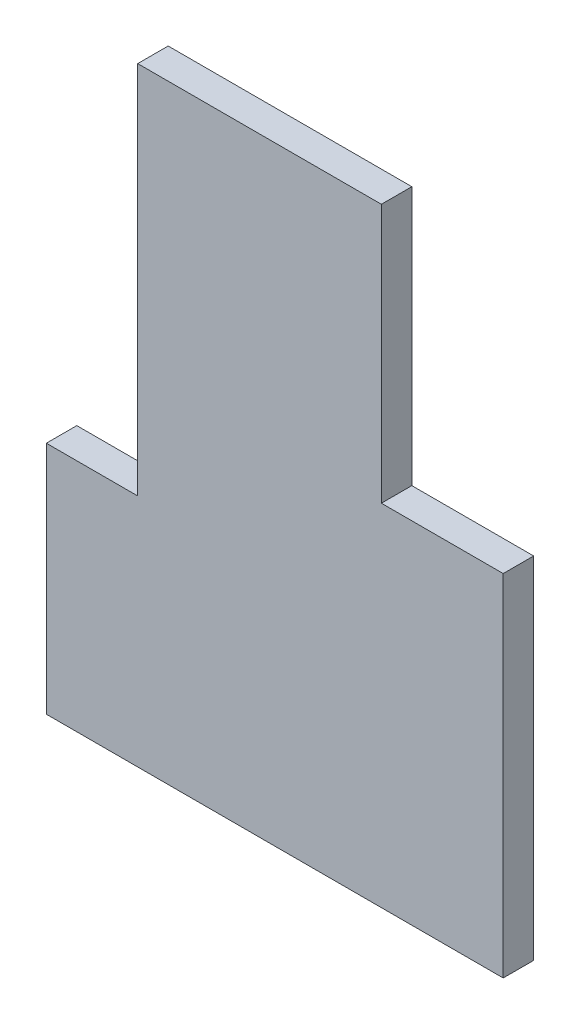
ISO-10303-21;
HEADER;
FILE_DESCRIPTION(('STEP AP214'),'2;1');
FILE_NAME('part.step','',(''),(''),'','','');
FILE_SCHEMA(('AUTOMOTIVE_DESIGN { 1 0 10303 214 1 1 1 1 }'));
ENDSEC;
DATA;
#1=APPLICATION_CONTEXT('core data for automotive mechanical design processes');
#2=APPLICATION_PROTOCOL_DEFINITION('international standard','automotive_design',2000,#1);
#3=PRODUCT_CONTEXT('',#1,'mechanical');
#4=PRODUCT('Part','Part','',(#3));
#5=PRODUCT_RELATED_PRODUCT_CATEGORY('part','',(#4));
#6=PRODUCT_DEFINITION_FORMATION('','',#4);
#7=PRODUCT_DEFINITION_CONTEXT('part definition',#1,'design');
#8=PRODUCT_DEFINITION('design','',#6,#7);
#9=PRODUCT_DEFINITION_SHAPE('','',#8);
#10=(LENGTH_UNIT() NAMED_UNIT(*) SI_UNIT(.MILLI.,.METRE.));
#11=(NAMED_UNIT(*) PLANE_ANGLE_UNIT() SI_UNIT($,.RADIAN.));
#12=(NAMED_UNIT(*) SI_UNIT($,.STERADIAN.) SOLID_ANGLE_UNIT());
#13=UNCERTAINTY_MEASURE_WITH_UNIT(LENGTH_MEASURE(1.E-05),#10,'distance_accuracy_value','');
#14=(GEOMETRIC_REPRESENTATION_CONTEXT(3) GLOBAL_UNCERTAINTY_ASSIGNED_CONTEXT((#13)) GLOBAL_UNIT_ASSIGNED_CONTEXT((#10,
#11,#12)) REPRESENTATION_CONTEXT('',''));
#15=CARTESIAN_POINT('',(0.,0.,0.));
#16=DIRECTION('',(0.,0.,1.));
#17=DIRECTION('',(1.,0.,0.));
#18=AXIS2_PLACEMENT_3D('',#15,#16,#17);
#19=CARTESIAN_POINT('',(-35.4556509146341,56.3295373294337,10.));
#20=DIRECTION('',(1.,0.,0.));
#21=DIRECTION('',(0.,0.,-1.));
#22=AXIS2_PLACEMENT_3D('',#19,#20,#21);
#23=PLANE('',#22);
#24=DIRECTION('',(0.,-1.,0.));
#25=VECTOR('',#24,1.);
#26=CARTESIAN_POINT('',(-35.4556509146341,56.3295373294337,0.));
#27=LINE('',#26,#25);
#28=CARTESIAN_POINT('',(-35.4556509146341,56.3295373294337,0.));
#29=VERTEX_POINT('',#28);
#30=CARTESIAN_POINT('',(-35.4556509146341,-20.7342987804878,0.));
#31=VERTEX_POINT('',#30);
#32=EDGE_CURVE('E129',#29,#31,#27,.T.);
#33=ORIENTED_EDGE('',*,*,#32,.T.);
#34=DIRECTION('',(0.,0.,-1.));
#35=VECTOR('',#34,1.);
#36=CARTESIAN_POINT('',(-35.4556509146341,-20.7342987804878,10.));
#37=LINE('',#36,#35);
#38=CARTESIAN_POINT('',(-35.4556509146341,-20.7342987804878,10.));
#39=VERTEX_POINT('',#38);
#40=EDGE_CURVE('E11',#39,#31,#37,.T.);
#41=ORIENTED_EDGE('',*,*,#40,.F.);
#42=DIRECTION('',(0.,-1.,0.));
#43=VECTOR('',#42,1.);
#44=CARTESIAN_POINT('',(-35.4556509146341,56.3295373294337,10.));
#45=LINE('',#44,#43);
#46=CARTESIAN_POINT('',(-35.4556509146341,56.3295373294337,10.));
#47=VERTEX_POINT('',#46);
#48=EDGE_CURVE('E143',#47,#39,#45,.T.);
#49=ORIENTED_EDGE('',*,*,#48,.F.);
#50=DIRECTION('',(0.,0.,-1.));
#51=VECTOR('',#50,1.);
#52=CARTESIAN_POINT('',(-35.4556509146341,56.3295373294337,10.));
#53=LINE('',#52,#51);
#54=EDGE_CURVE('E125',#47,#29,#53,.T.);
#55=ORIENTED_EDGE('',*,*,#54,.T.);
#56=EDGE_LOOP('',(#33,#41,#49,#55));
#57=FACE_BOUND('',#56,.T.);
#58=ADVANCED_FACE('F33',(#57),#23,.F.);
#59=CARTESIAN_POINT('',(-35.4556509146341,-20.7342987804878,10.));
#60=DIRECTION('',(0.,1.,0.));
#61=DIRECTION('',(0.,0.,1.));
#62=AXIS2_PLACEMENT_3D('',#59,#60,#61);
#63=PLANE('',#62);
#64=DIRECTION('',(1.,0.,0.));
#65=VECTOR('',#64,1.);
#66=CARTESIAN_POINT('',(-35.4556509146341,-20.7342987804878,0.));
#67=LINE('',#66,#65);
#68=CARTESIAN_POINT('',(114.544349085366,-20.7342987804878,0.));
#69=VERTEX_POINT('',#68);
#70=EDGE_CURVE('E132',#31,#69,#67,.T.);
#71=ORIENTED_EDGE('',*,*,#70,.T.);
#72=DIRECTION('',(0.,0.,-1.));
#73=VECTOR('',#72,1.);
#74=CARTESIAN_POINT('',(114.544349085366,-20.7342987804878,10.));
#75=LINE('',#74,#73);
#76=CARTESIAN_POINT('',(114.544349085366,-20.7342987804878,10.));
#77=VERTEX_POINT('',#76);
#78=EDGE_CURVE('E41',#77,#69,#75,.T.);
#79=ORIENTED_EDGE('',*,*,#78,.F.);
#80=DIRECTION('',(1.,0.,0.));
#81=VECTOR('',#80,1.);
#82=CARTESIAN_POINT('',(-35.4556509146341,-20.7342987804878,10.));
#83=LINE('',#82,#81);
#84=EDGE_CURVE('E92',#39,#77,#83,.T.);
#85=ORIENTED_EDGE('',*,*,#84,.F.);
#86=ORIENTED_EDGE('',*,*,#40,.T.);
#87=EDGE_LOOP('',(#71,#79,#85,#86));
#88=FACE_BOUND('',#87,.T.);
#89=ADVANCED_FACE('F178',(#88),#63,.F.);
#90=CARTESIAN_POINT('',(114.544349085366,-20.7342987804878,10.));
#91=DIRECTION('',(-1.,0.,0.));
#92=DIRECTION('',(0.,0.,1.));
#93=AXIS2_PLACEMENT_3D('',#90,#91,#92);
#94=PLANE('',#93);
#95=DIRECTION('',(0.,1.,0.));
#96=VECTOR('',#95,1.);
#97=CARTESIAN_POINT('',(114.544349085366,-20.7342987804878,0.));
#98=LINE('',#97,#96);
#99=CARTESIAN_POINT('',(114.544349085366,94.2657012195122,0.));
#100=VERTEX_POINT('',#99);
#101=EDGE_CURVE('E134',#69,#100,#98,.T.);
#102=ORIENTED_EDGE('',*,*,#101,.T.);
#103=DIRECTION('',(0.,0.,-1.));
#104=VECTOR('',#103,1.);
#105=CARTESIAN_POINT('',(114.544349085366,94.2657012195122,10.));
#106=LINE('',#105,#104);
#107=CARTESIAN_POINT('',(114.544349085366,94.2657012195122,10.));
#108=VERTEX_POINT('',#107);
#109=EDGE_CURVE('E150',#108,#100,#106,.T.);
#110=ORIENTED_EDGE('',*,*,#109,.F.);
#111=DIRECTION('',(0.,1.,0.));
#112=VECTOR('',#111,1.);
#113=CARTESIAN_POINT('',(114.544349085366,-20.7342987804878,10.));
#114=LINE('',#113,#112);
#115=EDGE_CURVE('E158',#77,#108,#114,.T.);
#116=ORIENTED_EDGE('',*,*,#115,.F.);
#117=ORIENTED_EDGE('',*,*,#78,.T.);
#118=EDGE_LOOP('',(#102,#110,#116,#117));
#119=FACE_BOUND('',#118,.T.);
#120=ADVANCED_FACE('F156',(#119),#94,.F.);
#121=CARTESIAN_POINT('',(114.544349085366,94.2657012195122,10.));
#122=DIRECTION('',(0.,-1.,0.));
#123=DIRECTION('',(0.,0.,-1.));
#124=AXIS2_PLACEMENT_3D('',#121,#122,#123);
#125=PLANE('',#124);
#126=DIRECTION('',(-1.,0.,0.));
#127=VECTOR('',#126,1.);
#128=CARTESIAN_POINT('',(114.544349085366,94.2657012195122,0.));
#129=LINE('',#128,#127);
#130=CARTESIAN_POINT('',(74.5443490853658,94.2657012195122,0.));
#131=VERTEX_POINT('',#130);
#132=EDGE_CURVE('E136',#100,#131,#129,.T.);
#133=ORIENTED_EDGE('',*,*,#132,.T.);
#134=DIRECTION('',(0.,0.,-1.));
#135=VECTOR('',#134,1.);
#136=CARTESIAN_POINT('',(74.5443490853658,94.2657012195122,10.));
#137=LINE('',#136,#135);
#138=CARTESIAN_POINT('',(74.5443490853658,94.2657012195122,10.));
#139=VERTEX_POINT('',#138);
#140=EDGE_CURVE('E147',#139,#131,#137,.T.);
#141=ORIENTED_EDGE('',*,*,#140,.F.);
#142=DIRECTION('',(-1.,0.,0.));
#143=VECTOR('',#142,1.);
#144=CARTESIAN_POINT('',(114.544349085366,94.2657012195122,10.));
#145=LINE('',#144,#143);
#146=EDGE_CURVE('E170',#108,#139,#145,.T.);
#147=ORIENTED_EDGE('',*,*,#146,.F.);
#148=ORIENTED_EDGE('',*,*,#109,.T.);
#149=EDGE_LOOP('',(#133,#141,#147,#148));
#150=FACE_BOUND('',#149,.T.);
#151=ADVANCED_FACE('F166',(#150),#125,.F.);
#152=CARTESIAN_POINT('',(74.5443490853658,94.2657012195122,10.));
#153=DIRECTION('',(-1.,0.,0.));
#154=DIRECTION('',(0.,0.,1.));
#155=AXIS2_PLACEMENT_3D('',#152,#153,#154);
#156=PLANE('',#155);
#157=DIRECTION('',(0.,1.,0.));
#158=VECTOR('',#157,1.);
#159=CARTESIAN_POINT('',(74.5443490853658,94.2657012195122,0.));
#160=LINE('',#159,#158);
#161=CARTESIAN_POINT('',(74.5443490853658,179.265701219512,0.));
#162=VERTEX_POINT('',#161);
#163=EDGE_CURVE('E138',#131,#162,#160,.T.);
#164=ORIENTED_EDGE('',*,*,#163,.T.);
#165=DIRECTION('',(0.,0.,-1.));
#166=VECTOR('',#165,1.);
#167=CARTESIAN_POINT('',(74.5443490853658,179.265701219512,10.));
#168=LINE('',#167,#166);
#169=CARTESIAN_POINT('',(74.5443490853658,179.265701219512,10.));
#170=VERTEX_POINT('',#169);
#171=EDGE_CURVE('E120',#170,#162,#168,.T.);
#172=ORIENTED_EDGE('',*,*,#171,.F.);
#173=DIRECTION('',(0.,1.,0.));
#174=VECTOR('',#173,1.);
#175=CARTESIAN_POINT('',(74.5443490853658,94.2657012195122,10.));
#176=LINE('',#175,#174);
#177=EDGE_CURVE('E111',#139,#170,#176,.T.);
#178=ORIENTED_EDGE('',*,*,#177,.F.);
#179=ORIENTED_EDGE('',*,*,#140,.T.);
#180=EDGE_LOOP('',(#164,#172,#178,#179));
#181=FACE_BOUND('',#180,.T.);
#182=ADVANCED_FACE('F169',(#181),#156,.F.);
#183=CARTESIAN_POINT('',(74.5443490853658,179.265701219512,10.));
#184=DIRECTION('',(0.,-1.,0.));
#185=DIRECTION('',(0.,0.,-1.));
#186=AXIS2_PLACEMENT_3D('',#183,#184,#185);
#187=PLANE('',#186);
#188=DIRECTION('',(-1.,0.,0.));
#189=VECTOR('',#188,1.);
#190=CARTESIAN_POINT('',(74.5443490853658,179.265701219512,0.));
#191=LINE('',#190,#189);
#192=CARTESIAN_POINT('',(-5.45565091463416,179.265701219512,0.));
#193=VERTEX_POINT('',#192);
#194=EDGE_CURVE('E119',#162,#193,#191,.T.);
#195=ORIENTED_EDGE('',*,*,#194,.T.);
#196=DIRECTION('',(0.,0.,-1.));
#197=VECTOR('',#196,1.);
#198=CARTESIAN_POINT('',(-5.45565091463416,179.265701219512,10.));
#199=LINE('',#198,#197);
#200=CARTESIAN_POINT('',(-5.45565091463416,179.265701219512,10.));
#201=VERTEX_POINT('',#200);
#202=EDGE_CURVE('E116',#201,#193,#199,.T.);
#203=ORIENTED_EDGE('',*,*,#202,.F.);
#204=DIRECTION('',(-1.,0.,0.));
#205=VECTOR('',#204,1.);
#206=CARTESIAN_POINT('',(74.5443490853658,179.265701219512,10.));
#207=LINE('',#206,#205);
#208=EDGE_CURVE('E105',#170,#201,#207,.T.);
#209=ORIENTED_EDGE('',*,*,#208,.F.);
#210=ORIENTED_EDGE('',*,*,#171,.T.);
#211=EDGE_LOOP('',(#195,#203,#209,#210));
#212=FACE_BOUND('',#211,.T.);
#213=ADVANCED_FACE('F117',(#212),#187,.F.);
#214=CARTESIAN_POINT('',(-5.45565091463416,56.3295373294337,10.));
#215=DIRECTION('',(1.,0.,0.));
#216=DIRECTION('',(0.,0.,-1.));
#217=AXIS2_PLACEMENT_3D('',#214,#215,#216);
#218=PLANE('',#217);
#219=DIRECTION('',(0.,-1.,0.));
#220=VECTOR('',#219,1.);
#221=CARTESIAN_POINT('',(-5.45565091463416,56.3295373294337,0.));
#222=LINE('',#221,#220);
#223=CARTESIAN_POINT('',(-5.45565091463416,56.3295373294337,0.));
#224=VERTEX_POINT('',#223);
#225=EDGE_CURVE('E78',#193,#224,#222,.T.);
#226=ORIENTED_EDGE('',*,*,#225,.T.);
#227=DIRECTION('',(0.,0.,-1.));
#228=VECTOR('',#227,1.);
#229=CARTESIAN_POINT('',(-5.45565091463416,56.3295373294337,10.));
#230=LINE('',#229,#228);
#231=CARTESIAN_POINT('',(-5.45565091463416,56.3295373294337,10.));
#232=VERTEX_POINT('',#231);
#233=EDGE_CURVE('E121',#232,#224,#230,.T.);
#234=ORIENTED_EDGE('',*,*,#233,.F.);
#235=DIRECTION('',(0.,-1.,0.));
#236=VECTOR('',#235,1.);
#237=CARTESIAN_POINT('',(-5.45565091463416,56.3295373294337,10.));
#238=LINE('',#237,#236);
#239=EDGE_CURVE('E109',#201,#232,#238,.T.);
#240=ORIENTED_EDGE('',*,*,#239,.F.);
#241=ORIENTED_EDGE('',*,*,#202,.T.);
#242=EDGE_LOOP('',(#226,#234,#240,#241));
#243=FACE_BOUND('',#242,.T.);
#244=ADVANCED_FACE('F123',(#243),#218,.F.);
#245=CARTESIAN_POINT('',(-35.4556509146341,56.3295373294337,10.));
#246=DIRECTION('',(0.,-1.,0.));
#247=DIRECTION('',(0.,0.,-1.));
#248=AXIS2_PLACEMENT_3D('',#245,#246,#247);
#249=PLANE('',#248);
#250=DIRECTION('',(-1.,0.,0.));
#251=VECTOR('',#250,1.);
#252=CARTESIAN_POINT('',(-35.4556509146341,56.3295373294337,0.));
#253=LINE('',#252,#251);
#254=EDGE_CURVE('E84',#224,#29,#253,.T.);
#255=ORIENTED_EDGE('',*,*,#254,.T.);
#256=ORIENTED_EDGE('',*,*,#54,.F.);
#257=DIRECTION('',(-1.,0.,0.));
#258=VECTOR('',#257,1.);
#259=CARTESIAN_POINT('',(-35.4556509146341,56.3295373294337,10.));
#260=LINE('',#259,#258);
#261=EDGE_CURVE('E49',#232,#47,#260,.T.);
#262=ORIENTED_EDGE('',*,*,#261,.F.);
#263=ORIENTED_EDGE('',*,*,#233,.T.);
#264=EDGE_LOOP('',(#255,#256,#262,#263));
#265=FACE_BOUND('',#264,.T.);
#266=ADVANCED_FACE('F194',(#265),#249,.F.);
#267=CARTESIAN_POINT('',(0.,0.,10.));
#268=DIRECTION('',(0.,0.,1.));
#269=DIRECTION('',(1.,0.,0.));
#270=AXIS2_PLACEMENT_3D('',#267,#268,#269);
#271=PLANE('',#270);
#272=ORIENTED_EDGE('',*,*,#48,.T.);
#273=ORIENTED_EDGE('',*,*,#84,.T.);
#274=ORIENTED_EDGE('',*,*,#115,.T.);
#275=ORIENTED_EDGE('',*,*,#146,.T.);
#276=ORIENTED_EDGE('',*,*,#177,.T.);
#277=ORIENTED_EDGE('',*,*,#208,.T.);
#278=ORIENTED_EDGE('',*,*,#239,.T.);
#279=ORIENTED_EDGE('',*,*,#261,.T.);
#280=EDGE_LOOP('',(#272,#273,#274,#275,#276,#277,#278,#279));
#281=FACE_BOUND('',#280,.T.);
#282=ADVANCED_FACE('F107',(#281),#271,.T.);
#283=CARTESIAN_POINT('',(0.,0.,0.));
#284=DIRECTION('',(0.,0.,1.));
#285=DIRECTION('',(1.,0.,0.));
#286=AXIS2_PLACEMENT_3D('',#283,#284,#285);
#287=PLANE('',#286);
#288=ORIENTED_EDGE('',*,*,#32,.F.);
#289=ORIENTED_EDGE('',*,*,#254,.F.);
#290=ORIENTED_EDGE('',*,*,#225,.F.);
#291=ORIENTED_EDGE('',*,*,#194,.F.);
#292=ORIENTED_EDGE('',*,*,#163,.F.);
#293=ORIENTED_EDGE('',*,*,#132,.F.);
#294=ORIENTED_EDGE('',*,*,#101,.F.);
#295=ORIENTED_EDGE('',*,*,#70,.F.);
#296=EDGE_LOOP('',(#288,#289,#290,#291,#292,#293,#294,#295));
#297=FACE_BOUND('',#296,.T.);
#298=ADVANCED_FACE('F162',(#297),#287,.F.);
#299=CLOSED_SHELL('',(#58,#89,#120,#151,#182,#213,#244,#266,#282,#298));
#300=MANIFOLD_SOLID_BREP('B2',#299);
#301=ADVANCED_BREP_SHAPE_REPRESENTATION('',(#18,#300),#14);
#302=SHAPE_DEFINITION_REPRESENTATION(#9,#301);
ENDSEC;
END-ISO-10303-21;
